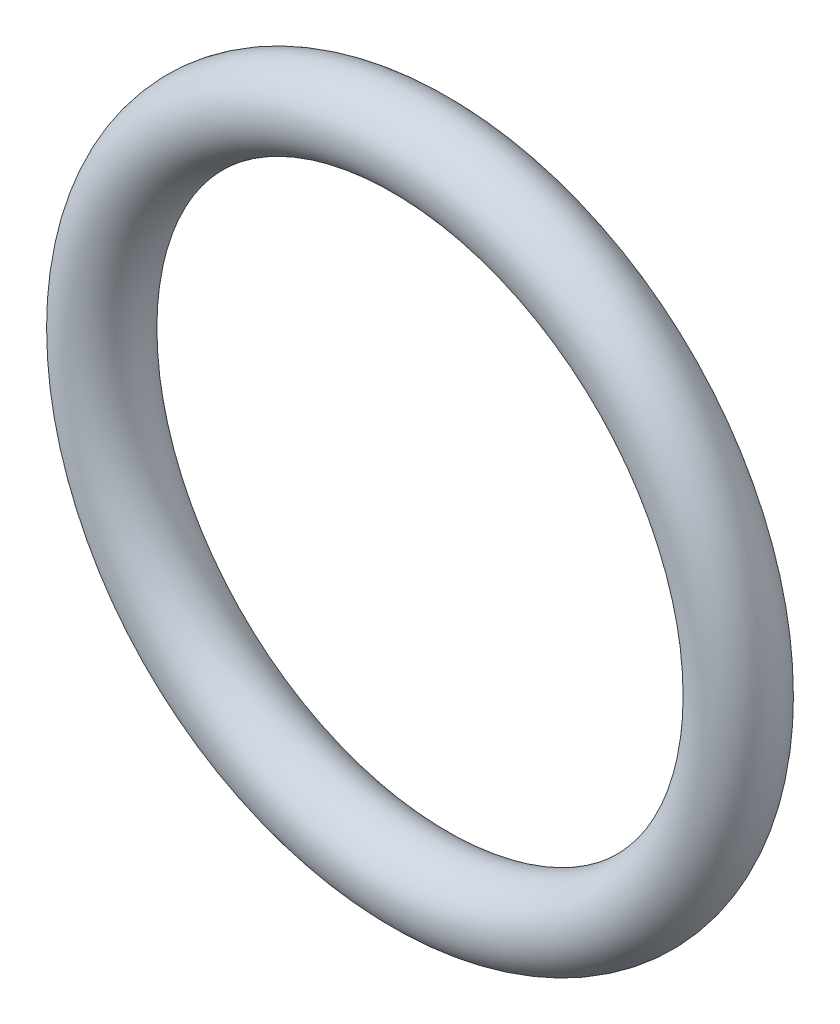
ISO-10303-21;
HEADER;
FILE_DESCRIPTION(('STEP AP214'),'2;1');
FILE_NAME('part.step','',(''),(''),'','','');
FILE_SCHEMA(('AUTOMOTIVE_DESIGN { 1 0 10303 214 1 1 1 1 }'));
ENDSEC;
DATA;
#1=APPLICATION_CONTEXT('core data for automotive mechanical design processes');
#2=APPLICATION_PROTOCOL_DEFINITION('international standard','automotive_design',2000,#1);
#3=PRODUCT_CONTEXT('',#1,'mechanical');
#4=PRODUCT('Part','Part','',(#3));
#5=PRODUCT_RELATED_PRODUCT_CATEGORY('part','',(#4));
#6=PRODUCT_DEFINITION_FORMATION('','',#4);
#7=PRODUCT_DEFINITION_CONTEXT('part definition',#1,'design');
#8=PRODUCT_DEFINITION('design','',#6,#7);
#9=PRODUCT_DEFINITION_SHAPE('','',#8);
#10=(LENGTH_UNIT() NAMED_UNIT(*) SI_UNIT(.MILLI.,.METRE.));
#11=(NAMED_UNIT(*) PLANE_ANGLE_UNIT() SI_UNIT($,.RADIAN.));
#12=(NAMED_UNIT(*) SI_UNIT($,.STERADIAN.) SOLID_ANGLE_UNIT());
#13=UNCERTAINTY_MEASURE_WITH_UNIT(LENGTH_MEASURE(1.E-05),#10,'distance_accuracy_value','');
#14=(GEOMETRIC_REPRESENTATION_CONTEXT(3) GLOBAL_UNCERTAINTY_ASSIGNED_CONTEXT((#13)) GLOBAL_UNIT_ASSIGNED_CONTEXT((#10,
#11,#12)) REPRESENTATION_CONTEXT('',''));
#15=CARTESIAN_POINT('',(0.,0.,0.));
#16=DIRECTION('',(0.,0.,1.));
#17=DIRECTION('',(1.,0.,0.));
#18=AXIS2_PLACEMENT_3D('',#15,#16,#17);
#19=CARTESIAN_POINT('',(0.,0.,0.));
#20=DIRECTION('',(0.,0.,1.));
#21=DIRECTION('',(1.,0.,0.));
#22=AXIS2_PLACEMENT_3D('',#19,#20,#21);
#23=TOROIDAL_SURFACE('',#22,10.668,1.3081);
#24=CARTESIAN_POINT('',(11.9761,0.,0.));
#25=VERTEX_POINT('',#24);
#26=VERTEX_LOOP('',#25);
#27=FACE_BOUND('',#26,.T.);
#28=ADVANCED_FACE('F33',(#27),#23,.T.);
#29=CLOSED_SHELL('',(#28));
#30=MANIFOLD_SOLID_BREP('B2',#29);
#31=ADVANCED_BREP_SHAPE_REPRESENTATION('',(#18,#30),#14);
#32=SHAPE_DEFINITION_REPRESENTATION(#9,#31);
ENDSEC;
END-ISO-10303-21;
